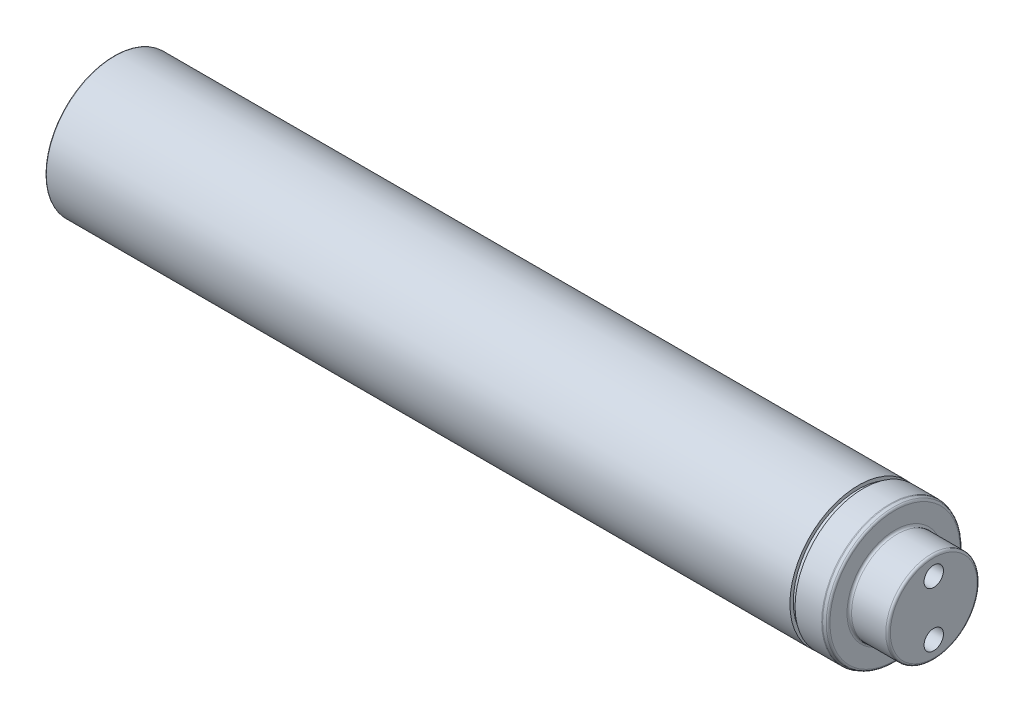
ISO-10303-21;
HEADER;
FILE_DESCRIPTION(('STEP AP214'),'2;1');
FILE_NAME('part.step','',(''),(''),'','','');
FILE_SCHEMA(('AUTOMOTIVE_DESIGN { 1 0 10303 214 1 1 1 1 }'));
ENDSEC;
DATA;
#1=APPLICATION_CONTEXT('core data for automotive mechanical design processes');
#2=APPLICATION_PROTOCOL_DEFINITION('international standard','automotive_design',2000,#1);
#3=PRODUCT_CONTEXT('',#1,'mechanical');
#4=PRODUCT('Part','Part','',(#3));
#5=PRODUCT_RELATED_PRODUCT_CATEGORY('part','',(#4));
#6=PRODUCT_DEFINITION_FORMATION('','',#4);
#7=PRODUCT_DEFINITION_CONTEXT('part definition',#1,'design');
#8=PRODUCT_DEFINITION('design','',#6,#7);
#9=PRODUCT_DEFINITION_SHAPE('','',#8);
#10=(LENGTH_UNIT() NAMED_UNIT(*) SI_UNIT(.MILLI.,.METRE.));
#11=(NAMED_UNIT(*) PLANE_ANGLE_UNIT() SI_UNIT($,.RADIAN.));
#12=(NAMED_UNIT(*) SI_UNIT($,.STERADIAN.) SOLID_ANGLE_UNIT());
#13=UNCERTAINTY_MEASURE_WITH_UNIT(LENGTH_MEASURE(1.E-05),#10,'distance_accuracy_value','');
#14=(GEOMETRIC_REPRESENTATION_CONTEXT(3) GLOBAL_UNCERTAINTY_ASSIGNED_CONTEXT((#13)) GLOBAL_UNIT_ASSIGNED_CONTEXT((#10,
#11,#12)) REPRESENTATION_CONTEXT('',''));
#15=CARTESIAN_POINT('',(0.,0.,0.));
#16=DIRECTION('',(0.,0.,1.));
#17=DIRECTION('',(1.,0.,0.));
#18=AXIS2_PLACEMENT_3D('',#15,#16,#17);
#19=CARTESIAN_POINT('',(-163.4,0.,0.));
#20=DIRECTION('',(-1.,0.,0.));
#21=DIRECTION('',(0.,0.,1.));
#22=AXIS2_PLACEMENT_3D('',#19,#20,#21);
#23=TOROIDAL_SURFACE('',#22,28.4000000000005,0.400000000000006);
#24=CARTESIAN_POINT('',(-163.,0.,-1.11022302462516E-13));
#25=DIRECTION('',(-1.,0.,0.));
#26=DIRECTION('',(0.,0.,1.));
#27=AXIS2_PLACEMENT_3D('',#24,#25,#26);
#28=CIRCLE('',#27,28.4000000000005);
#29=CARTESIAN_POINT('',(-163.,0.,28.4000000000005));
#30=VERTEX_POINT('',#29);
#31=EDGE_CURVE('E87',#30,#30,#28,.T.);
#32=ORIENTED_EDGE('',*,*,#31,.T.);
#33=EDGE_LOOP('',(#32));
#34=FACE_BOUND('',#33,.T.);
#35=CARTESIAN_POINT('',(-163.4,0.,0.));
#36=DIRECTION('',(-1.,0.,0.));
#37=DIRECTION('',(0.,0.,1.));
#38=AXIS2_PLACEMENT_3D('',#35,#36,#37);
#39=CIRCLE('',#38,28.0000000000005);
#40=CARTESIAN_POINT('',(-163.4,0.,28.0000000000006));
#41=VERTEX_POINT('',#40);
#42=EDGE_CURVE('E11',#41,#41,#39,.T.);
#43=ORIENTED_EDGE('',*,*,#42,.F.);
#44=EDGE_LOOP('',(#43));
#45=FACE_BOUND('',#44,.T.);
#46=ADVANCED_FACE('F49',(#34,#45),#23,.F.);
#47=CARTESIAN_POINT('',(-168.,0.,-1.11022302462516E-13));
#48=DIRECTION('',(-1.,0.,0.));
#49=DIRECTION('',(0.,0.,1.));
#50=AXIS2_PLACEMENT_3D('',#47,#48,#49);
#51=CYLINDRICAL_SURFACE('',#50,28.0000000000005);
#52=CARTESIAN_POINT('',(-164.,0.,-1.11022302462516E-13));
#53=DIRECTION('',(-1.,0.,0.));
#54=DIRECTION('',(0.,0.,1.));
#55=AXIS2_PLACEMENT_3D('',#52,#53,#54);
#56=CIRCLE('',#55,28.0000000000005);
#57=CARTESIAN_POINT('',(-164.,0.,28.0000000000005));
#58=VERTEX_POINT('',#57);
#59=EDGE_CURVE('E56',#58,#58,#56,.T.);
#60=ORIENTED_EDGE('',*,*,#59,.F.);
#61=EDGE_LOOP('',(#60));
#62=FACE_BOUND('',#61,.T.);
#63=ORIENTED_EDGE('',*,*,#42,.T.);
#64=EDGE_LOOP('',(#63));
#65=FACE_BOUND('',#64,.T.);
#66=ADVANCED_FACE('F154',(#62,#65),#51,.T.);
#67=CARTESIAN_POINT('',(-164.,28.0000000000009,0.));
#68=DIRECTION('',(1.,0.,0.));
#69=DIRECTION('',(0.,0.,-1.));
#70=AXIS2_PLACEMENT_3D('',#67,#68,#69);
#71=PLANE('',#70);
#72=CARTESIAN_POINT('',(-164.,0.,-1.11022302462516E-13));
#73=DIRECTION('',(-1.,0.,0.));
#74=DIRECTION('',(0.,0.,1.));
#75=AXIS2_PLACEMENT_3D('',#72,#73,#74);
#76=CIRCLE('',#75,25.2309401076756);
#77=CARTESIAN_POINT('',(-164.,0.,25.2309401076755));
#78=VERTEX_POINT('',#77);
#79=EDGE_CURVE('E147',#78,#78,#76,.T.);
#80=ORIENTED_EDGE('',*,*,#79,.F.);
#81=EDGE_LOOP('',(#80));
#82=FACE_BOUND('',#81,.T.);
#83=ORIENTED_EDGE('',*,*,#59,.T.);
#84=EDGE_LOOP('',(#83));
#85=FACE_BOUND('',#84,.T.);
#86=ADVANCED_FACE('F152',(#82,#85),#71,.F.);
#87=CARTESIAN_POINT('',(-164.4,0.,0.));
#88=DIRECTION('',(-1.,0.,0.));
#89=DIRECTION('',(0.,0.,1.));
#90=AXIS2_PLACEMENT_3D('',#87,#88,#89);
#91=TOROIDAL_SURFACE('',#90,25.2309401076756,0.400000000000032);
#92=ORIENTED_EDGE('',*,*,#79,.T.);
#93=EDGE_LOOP('',(#92));
#94=FACE_BOUND('',#93,.T.);
#95=CARTESIAN_POINT('',(-164.2,6.66133814775094E-13,2.22044604925031E-13));
#96=DIRECTION('',(-1.,0.,0.));
#97=DIRECTION('',(0.,0.,1.));
#98=AXIS2_PLACEMENT_3D('',#95,#96,#97);
#99=CIRCLE('',#98,24.884529946162);
#100=CARTESIAN_POINT('',(-164.2,6.67515183680254E-13,24.8845299461623));
#101=VERTEX_POINT('',#100);
#102=EDGE_CURVE('E144',#101,#101,#99,.T.);
#103=ORIENTED_EDGE('',*,*,#102,.F.);
#104=EDGE_LOOP('',(#103));
#105=FACE_BOUND('',#104,.T.);
#106=ADVANCED_FACE('F250',(#94,#105),#91,.F.);
#107=CARTESIAN_POINT('',(-164.2,6.66133814775094E-13,2.22044604925031E-13));
#108=DIRECTION('',(1.,0.,0.));
#109=DIRECTION('',(0.,0.,-1.));
#110=AXIS2_PLACEMENT_3D('',#107,#108,#109);
#111=CONICAL_SURFACE('',#110,24.884529946162,0.52359877559915);
#112=CARTESIAN_POINT('',(-167.8,0.,0.));
#113=DIRECTION('',(-1.,0.,0.));
#114=DIRECTION('',(0.,0.,1.));
#115=AXIS2_PLACEMENT_3D('',#112,#113,#114);
#116=CIRCLE('',#115,22.8060689770749);
#117=CARTESIAN_POINT('',(-167.8,0.,22.806068977075));
#118=VERTEX_POINT('',#117);
#119=EDGE_CURVE('E141',#118,#118,#116,.T.);
#120=ORIENTED_EDGE('',*,*,#119,.F.);
#121=EDGE_LOOP('',(#120));
#122=FACE_BOUND('',#121,.T.);
#123=ORIENTED_EDGE('',*,*,#102,.T.);
#124=EDGE_LOOP('',(#123));
#125=FACE_BOUND('',#124,.T.);
#126=ADVANCED_FACE('F246',(#122,#125),#111,.T.);
#127=CARTESIAN_POINT('',(-167.6,0.,0.));
#128=DIRECTION('',(-1.,0.,0.));
#129=DIRECTION('',(0.,0.,1.));
#130=AXIS2_PLACEMENT_3D('',#127,#128,#129);
#131=TOROIDAL_SURFACE('',#130,22.4596588155613,0.399999999999996);
#132=CARTESIAN_POINT('',(-168.,0.,-1.11022302462516E-13));
#133=DIRECTION('',(-1.,0.,0.));
#134=DIRECTION('',(0.,0.,1.));
#135=AXIS2_PLACEMENT_3D('',#132,#133,#134);
#136=CIRCLE('',#135,22.4596588155613);
#137=CARTESIAN_POINT('',(-168.,0.,22.4596588155613));
#138=VERTEX_POINT('',#137);
#139=EDGE_CURVE('E138',#138,#138,#136,.T.);
#140=ORIENTED_EDGE('',*,*,#139,.F.);
#141=EDGE_LOOP('',(#140));
#142=FACE_BOUND('',#141,.T.);
#143=ORIENTED_EDGE('',*,*,#119,.T.);
#144=EDGE_LOOP('',(#143));
#145=FACE_BOUND('',#144,.T.);
#146=ADVANCED_FACE('F242',(#142,#145),#131,.T.);
#147=CARTESIAN_POINT('',(-168.,22.4596588155623,-1.11022302462516E-13));
#148=DIRECTION('',(1.,0.,0.));
#149=DIRECTION('',(0.,0.,-1.));
#150=AXIS2_PLACEMENT_3D('',#147,#148,#149);
#151=PLANE('',#150);
#152=CARTESIAN_POINT('',(-168.,0.,-1.11022302462516E-13));
#153=DIRECTION('',(-1.,0.,0.));
#154=DIRECTION('',(0.,0.,1.));
#155=AXIS2_PLACEMENT_3D('',#152,#153,#154);
#156=CIRCLE('',#155,5.1);
#157=CARTESIAN_POINT('',(-168.,0.,5.0999999999999));
#158=VERTEX_POINT('',#157);
#159=EDGE_CURVE('E135',#158,#158,#156,.T.);
#160=ORIENTED_EDGE('',*,*,#159,.F.);
#161=EDGE_LOOP('',(#160));
#162=FACE_BOUND('',#161,.T.);
#163=ORIENTED_EDGE('',*,*,#139,.T.);
#164=EDGE_LOOP('',(#163));
#165=FACE_BOUND('',#164,.T.);
#166=ADVANCED_FACE('F238',(#162,#165),#151,.F.);
#167=CARTESIAN_POINT('',(-168.,0.,-1.11022302462516E-13));
#168=DIRECTION('',(-1.,0.,0.));
#169=DIRECTION('',(0.,0.,1.));
#170=AXIS2_PLACEMENT_3D('',#167,#168,#169);
#171=CYLINDRICAL_SURFACE('',#170,5.1);
#172=CARTESIAN_POINT('',(-148.,0.,-1.11022302462516E-13));
#173=DIRECTION('',(-1.,0.,0.));
#174=DIRECTION('',(0.,0.,1.));
#175=AXIS2_PLACEMENT_3D('',#172,#173,#174);
#176=CIRCLE('',#175,5.1);
#177=CARTESIAN_POINT('',(-148.,0.,5.0999999999999));
#178=VERTEX_POINT('',#177);
#179=EDGE_CURVE('E132',#178,#178,#176,.T.);
#180=ORIENTED_EDGE('',*,*,#179,.F.);
#181=EDGE_LOOP('',(#180));
#182=FACE_BOUND('',#181,.T.);
#183=ORIENTED_EDGE('',*,*,#159,.T.);
#184=EDGE_LOOP('',(#183));
#185=FACE_BOUND('',#184,.T.);
#186=ADVANCED_FACE('F235',(#182,#185),#171,.F.);
#187=CARTESIAN_POINT('',(-148.,0.,-1.11022302462516E-13));
#188=DIRECTION('',(-1.,0.,0.));
#189=DIRECTION('',(0.,0.,1.));
#190=AXIS2_PLACEMENT_3D('',#187,#188,#189);
#191=CONICAL_SURFACE('',#190,5.1,1.0471975511966);
#192=CARTESIAN_POINT('',(-145.055513627133,0.,-1.11022302462516E-13));
#193=VERTEX_POINT('',#192);
#194=VERTEX_LOOP('',#193);
#195=FACE_BOUND('',#194,.T.);
#196=ORIENTED_EDGE('',*,*,#179,.T.);
#197=EDGE_LOOP('',(#196));
#198=FACE_BOUND('',#197,.T.);
#199=ADVANCED_FACE('F231',(#195,#198),#191,.F.);
#200=CARTESIAN_POINT('',(196.,19.000000000001,3.88578058618805E-13));
#201=DIRECTION('',(1.,0.,0.));
#202=DIRECTION('',(0.,0.,-1.));
#203=AXIS2_PLACEMENT_3D('',#200,#201,#202);
#204=PLANE('',#203);
#205=CARTESIAN_POINT('',(196.,12.0000000000009,0.));
#206=DIRECTION('',(1.,0.,0.));
#207=DIRECTION('',(0.,0.,-1.));
#208=AXIS2_PLACEMENT_3D('',#205,#206,#207);
#209=CIRCLE('',#208,4.25);
#210=CARTESIAN_POINT('',(196.,12.0000000000009,-4.25000000000007));
#211=VERTEX_POINT('',#210);
#212=EDGE_CURVE('E77',#211,#211,#209,.T.);
#213=ORIENTED_EDGE('',*,*,#212,.F.);
#214=EDGE_LOOP('',(#213));
#215=FACE_BOUND('',#214,.T.);
#216=CARTESIAN_POINT('',(196.,-11.9999999999993,1.11022302462516E-13));
#217=DIRECTION('',(1.,0.,0.));
#218=DIRECTION('',(0.,0.,-1.));
#219=AXIS2_PLACEMENT_3D('',#216,#217,#218);
#220=CIRCLE('',#219,4.25);
#221=CARTESIAN_POINT('',(196.,-11.9999999999993,-4.2499999999999));
#222=VERTEX_POINT('',#221);
#223=EDGE_CURVE('E76',#222,#222,#220,.T.);
#224=ORIENTED_EDGE('',*,*,#223,.F.);
#225=EDGE_LOOP('',(#224));
#226=FACE_BOUND('',#225,.T.);
#227=CARTESIAN_POINT('',(196.,0.,-1.11022302462516E-13));
#228=DIRECTION('',(-1.,0.,0.));
#229=DIRECTION('',(0.,0.,1.));
#230=AXIS2_PLACEMENT_3D('',#227,#228,#229);
#231=CIRCLE('',#230,19.);
#232=CARTESIAN_POINT('',(196.,0.,18.9999999999999));
#233=VERTEX_POINT('',#232);
#234=EDGE_CURVE('E129',#233,#233,#231,.T.);
#235=ORIENTED_EDGE('',*,*,#234,.F.);
#236=EDGE_LOOP('',(#235));
#237=FACE_BOUND('',#236,.T.);
#238=ADVANCED_FACE('F227',(#215,#226,#237),#204,.T.);
#239=CARTESIAN_POINT('',(195.,6.66133814775094E-13,2.22044604925031E-13));
#240=DIRECTION('',(-1.,0.,0.));
#241=DIRECTION('',(0.,0.,1.));
#242=AXIS2_PLACEMENT_3D('',#239,#240,#241);
#243=TOROIDAL_SURFACE('',#242,19.,1.);
#244=ORIENTED_EDGE('',*,*,#234,.T.);
#245=EDGE_LOOP('',(#244));
#246=FACE_BOUND('',#245,.T.);
#247=CARTESIAN_POINT('',(195.,6.66133814775094E-13,2.22044604925031E-13));
#248=DIRECTION('',(-1.,0.,0.));
#249=DIRECTION('',(0.,0.,1.));
#250=AXIS2_PLACEMENT_3D('',#247,#248,#249);
#251=CIRCLE('',#250,20.);
#252=CARTESIAN_POINT('',(195.,6.67244037799719E-13,20.0000000000003));
#253=VERTEX_POINT('',#252);
#254=EDGE_CURVE('E126',#253,#253,#251,.T.);
#255=ORIENTED_EDGE('',*,*,#254,.F.);
#256=EDGE_LOOP('',(#255));
#257=FACE_BOUND('',#256,.T.);
#258=ADVANCED_FACE('F223',(#246,#257),#243,.T.);
#259=CARTESIAN_POINT('',(-168.,0.,-1.11022302462516E-13));
#260=DIRECTION('',(-1.,0.,0.));
#261=DIRECTION('',(0.,0.,1.));
#262=AXIS2_PLACEMENT_3D('',#259,#260,#261);
#263=CYLINDRICAL_SURFACE('',#262,20.);
#264=ORIENTED_EDGE('',*,*,#254,.T.);
#265=EDGE_LOOP('',(#264));
#266=FACE_BOUND('',#265,.T.);
#267=CARTESIAN_POINT('',(180.,0.,0.));
#268=DIRECTION('',(-1.,0.,0.));
#269=DIRECTION('',(0.,0.,1.));
#270=AXIS2_PLACEMENT_3D('',#267,#268,#269);
#271=CIRCLE('',#270,20.);
#272=CARTESIAN_POINT('',(180.,0.,20.));
#273=VERTEX_POINT('',#272);
#274=EDGE_CURVE('E123',#273,#273,#271,.T.);
#275=ORIENTED_EDGE('',*,*,#274,.F.);
#276=EDGE_LOOP('',(#275));
#277=FACE_BOUND('',#276,.T.);
#278=ADVANCED_FACE('F219',(#266,#277),#263,.T.);
#279=CARTESIAN_POINT('',(180.,0.,0.));
#280=DIRECTION('',(-1.,0.,0.));
#281=DIRECTION('',(0.,0.,1.));
#282=AXIS2_PLACEMENT_3D('',#279,#280,#281);
#283=TOROIDAL_SURFACE('',#282,21.,1.);
#284=CARTESIAN_POINT('',(179.,0.,0.));
#285=DIRECTION('',(-1.,0.,0.));
#286=DIRECTION('',(0.,0.,1.));
#287=AXIS2_PLACEMENT_3D('',#284,#285,#286);
#288=CIRCLE('',#287,21.);
#289=CARTESIAN_POINT('',(179.,0.,21.));
#290=VERTEX_POINT('',#289);
#291=EDGE_CURVE('E120',#290,#290,#288,.T.);
#292=ORIENTED_EDGE('',*,*,#291,.F.);
#293=EDGE_LOOP('',(#292));
#294=FACE_BOUND('',#293,.T.);
#295=ORIENTED_EDGE('',*,*,#274,.T.);
#296=EDGE_LOOP('',(#295));
#297=FACE_BOUND('',#296,.T.);
#298=ADVANCED_FACE('F215',(#294,#297),#283,.F.);
#299=CARTESIAN_POINT('',(179.,28.471851993259,2.22044604925031E-13));
#300=DIRECTION('',(1.,0.,0.));
#301=DIRECTION('',(0.,0.,-1.));
#302=AXIS2_PLACEMENT_3D('',#299,#300,#301);
#303=PLANE('',#302);
#304=ORIENTED_EDGE('',*,*,#291,.T.);
#305=EDGE_LOOP('',(#304));
#306=FACE_BOUND('',#305,.T.);
#307=CARTESIAN_POINT('',(179.,0.,0.));
#308=DIRECTION('',(-1.,0.,0.));
#309=DIRECTION('',(0.,0.,1.));
#310=AXIS2_PLACEMENT_3D('',#307,#308,#309);
#311=CIRCLE('',#310,28.4718519932579);
#312=CARTESIAN_POINT('',(179.,0.,28.471851993258));
#313=VERTEX_POINT('',#312);
#314=EDGE_CURVE('E117',#313,#313,#311,.T.);
#315=ORIENTED_EDGE('',*,*,#314,.F.);
#316=EDGE_LOOP('',(#315));
#317=FACE_BOUND('',#316,.T.);
#318=ADVANCED_FACE('F211',(#306,#317),#303,.T.);
#319=CARTESIAN_POINT('',(178.,0.,0.));
#320=DIRECTION('',(-1.,0.,0.));
#321=DIRECTION('',(0.,0.,1.));
#322=AXIS2_PLACEMENT_3D('',#319,#320,#321);
#323=TOROIDAL_SURFACE('',#322,28.4718519932579,1.);
#324=CARTESIAN_POINT('',(178.342020143326,0.,0.));
#325=DIRECTION('',(-1.,0.,0.));
#326=DIRECTION('',(0.,0.,1.));
#327=AXIS2_PLACEMENT_3D('',#324,#325,#326);
#328=CIRCLE('',#327,29.4115446140438);
#329=CARTESIAN_POINT('',(178.342020143326,0.,29.4115446140439));
#330=VERTEX_POINT('',#329);
#331=EDGE_CURVE('E114',#330,#330,#328,.T.);
#332=ORIENTED_EDGE('',*,*,#331,.F.);
#333=EDGE_LOOP('',(#332));
#334=FACE_BOUND('',#333,.T.);
#335=ORIENTED_EDGE('',*,*,#314,.T.);
#336=EDGE_LOOP('',(#335));
#337=FACE_BOUND('',#336,.T.);
#338=ADVANCED_FACE('F207',(#334,#337),#323,.T.);
#339=CARTESIAN_POINT('',(178.342020143326,0.,0.));
#340=DIRECTION('',(-1.,0.,0.));
#341=DIRECTION('',(0.,0.,1.));
#342=AXIS2_PLACEMENT_3D('',#339,#340,#341);
#343=CONICAL_SURFACE('',#342,29.4115446140438,0.349065850398855);
#344=CARTESIAN_POINT('',(177.165693162617,0.,0.));
#345=DIRECTION('',(-1.,0.,0.));
#346=DIRECTION('',(0.,0.,1.));
#347=AXIS2_PLACEMENT_3D('',#344,#345,#346);
#348=CIRCLE('',#347,29.8396926207859);
#349=CARTESIAN_POINT('',(177.165693162617,0.,29.839692620786));
#350=VERTEX_POINT('',#349);
#351=EDGE_CURVE('E111',#350,#350,#348,.T.);
#352=ORIENTED_EDGE('',*,*,#351,.F.);
#353=EDGE_LOOP('',(#352));
#354=FACE_BOUND('',#353,.T.);
#355=ORIENTED_EDGE('',*,*,#331,.T.);
#356=EDGE_LOOP('',(#355));
#357=FACE_BOUND('',#356,.T.);
#358=ADVANCED_FACE('F203',(#354,#357),#343,.T.);
#359=CARTESIAN_POINT('',(176.823673019292,0.,0.));
#360=DIRECTION('',(-1.,0.,0.));
#361=DIRECTION('',(0.,0.,1.));
#362=AXIS2_PLACEMENT_3D('',#359,#360,#361);
#363=TOROIDAL_SURFACE('',#362,28.9,1.);
#364=ORIENTED_EDGE('',*,*,#351,.T.);
#365=EDGE_LOOP('',(#364));
#366=FACE_BOUND('',#365,.T.);
#367=CARTESIAN_POINT('',(176.823673019292,0.,0.));
#368=DIRECTION('',(-1.,0.,0.));
#369=DIRECTION('',(0.,0.,1.));
#370=AXIS2_PLACEMENT_3D('',#367,#368,#369);
#371=CIRCLE('',#370,29.9);
#372=CARTESIAN_POINT('',(176.823673019292,0.,29.9000000000001));
#373=VERTEX_POINT('',#372);
#374=EDGE_CURVE('E108',#373,#373,#371,.T.);
#375=ORIENTED_EDGE('',*,*,#374,.F.);
#376=EDGE_LOOP('',(#375));
#377=FACE_BOUND('',#376,.T.);
#378=ADVANCED_FACE('F199',(#366,#377),#363,.T.);
#379=CARTESIAN_POINT('',(-168.,0.,-1.11022302462516E-13));
#380=DIRECTION('',(-1.,0.,0.));
#381=DIRECTION('',(0.,0.,1.));
#382=AXIS2_PLACEMENT_3D('',#379,#380,#381);
#383=CYLINDRICAL_SURFACE('',#382,29.9);
#384=ORIENTED_EDGE('',*,*,#374,.T.);
#385=EDGE_LOOP('',(#384));
#386=FACE_BOUND('',#385,.T.);
#387=CARTESIAN_POINT('',(165.15,0.,0.));
#388=DIRECTION('',(-1.,0.,0.));
#389=DIRECTION('',(0.,0.,1.));
#390=AXIS2_PLACEMENT_3D('',#387,#388,#389);
#391=CIRCLE('',#390,29.9);
#392=CARTESIAN_POINT('',(165.15,0.,29.9000000000001));
#393=VERTEX_POINT('',#392);
#394=EDGE_CURVE('E105',#393,#393,#391,.T.);
#395=ORIENTED_EDGE('',*,*,#394,.F.);
#396=EDGE_LOOP('',(#395));
#397=FACE_BOUND('',#396,.T.);
#398=ADVANCED_FACE('F195',(#386,#397),#383,.T.);
#399=CARTESIAN_POINT('',(165.15,28.5000000000011,3.33066907387547E-13));
#400=DIRECTION('',(-1.,0.,0.));
#401=DIRECTION('',(0.,0.,1.));
#402=AXIS2_PLACEMENT_3D('',#399,#400,#401);
#403=PLANE('',#402);
#404=ORIENTED_EDGE('',*,*,#394,.T.);
#405=EDGE_LOOP('',(#404));
#406=FACE_BOUND('',#405,.T.);
#407=CARTESIAN_POINT('',(165.15,0.,0.));
#408=DIRECTION('',(-1.,0.,0.));
#409=DIRECTION('',(0.,0.,1.));
#410=AXIS2_PLACEMENT_3D('',#407,#408,#409);
#411=CIRCLE('',#410,28.5000000000001);
#412=CARTESIAN_POINT('',(165.15,0.,28.5000000000002));
#413=VERTEX_POINT('',#412);
#414=EDGE_CURVE('E102',#413,#413,#411,.T.);
#415=ORIENTED_EDGE('',*,*,#414,.F.);
#416=EDGE_LOOP('',(#415));
#417=FACE_BOUND('',#416,.T.);
#418=ADVANCED_FACE('F191',(#406,#417),#403,.T.);
#419=CARTESIAN_POINT('',(-168.,0.,-1.11022302462516E-13));
#420=DIRECTION('',(-1.,0.,0.));
#421=DIRECTION('',(0.,0.,1.));
#422=AXIS2_PLACEMENT_3D('',#419,#420,#421);
#423=CYLINDRICAL_SURFACE('',#422,28.5000000000001);
#424=ORIENTED_EDGE('',*,*,#414,.T.);
#425=EDGE_LOOP('',(#424));
#426=FACE_BOUND('',#425,.T.);
#427=CARTESIAN_POINT('',(163.,0.,0.));
#428=DIRECTION('',(-1.,0.,0.));
#429=DIRECTION('',(0.,0.,1.));
#430=AXIS2_PLACEMENT_3D('',#427,#428,#429);
#431=CIRCLE('',#430,28.5000000000001);
#432=CARTESIAN_POINT('',(163.,0.,28.5000000000002));
#433=VERTEX_POINT('',#432);
#434=EDGE_CURVE('E99',#433,#433,#431,.T.);
#435=ORIENTED_EDGE('',*,*,#434,.F.);
#436=EDGE_LOOP('',(#435));
#437=FACE_BOUND('',#436,.T.);
#438=ADVANCED_FACE('F187',(#426,#437),#423,.T.);
#439=CARTESIAN_POINT('',(163.,30.0000000000005,1.66533453693773E-13));
#440=DIRECTION('',(1.,0.,0.));
#441=DIRECTION('',(0.,0.,-1.));
#442=AXIS2_PLACEMENT_3D('',#439,#440,#441);
#443=PLANE('',#442);
#444=ORIENTED_EDGE('',*,*,#434,.T.);
#445=EDGE_LOOP('',(#444));
#446=FACE_BOUND('',#445,.T.);
#447=CARTESIAN_POINT('',(163.,0.,0.));
#448=DIRECTION('',(-1.,0.,0.));
#449=DIRECTION('',(0.,0.,1.));
#450=AXIS2_PLACEMENT_3D('',#447,#448,#449);
#451=CIRCLE('',#450,29.9999999999999);
#452=CARTESIAN_POINT('',(163.,0.,30.));
#453=VERTEX_POINT('',#452);
#454=EDGE_CURVE('E96',#453,#453,#451,.T.);
#455=ORIENTED_EDGE('',*,*,#454,.F.);
#456=EDGE_LOOP('',(#455));
#457=FACE_BOUND('',#456,.T.);
#458=ADVANCED_FACE('F180',(#446,#457),#443,.T.);
#459=CARTESIAN_POINT('',(-168.,0.,-1.11022302462516E-13));
#460=DIRECTION('',(-1.,0.,0.));
#461=DIRECTION('',(0.,0.,1.));
#462=AXIS2_PLACEMENT_3D('',#459,#460,#461);
#463=CYLINDRICAL_SURFACE('',#462,29.9999999999999);
#464=CARTESIAN_POINT('',(-162.6,0.,0.));
#465=DIRECTION('',(-1.,0.,0.));
#466=DIRECTION('',(0.,0.,1.));
#467=AXIS2_PLACEMENT_3D('',#464,#465,#466);
#468=CIRCLE('',#467,29.9999999999999);
#469=CARTESIAN_POINT('',(-162.6,0.,30.));
#470=VERTEX_POINT('',#469);
#471=EDGE_CURVE('E93',#470,#470,#468,.T.);
#472=ORIENTED_EDGE('',*,*,#471,.F.);
#473=EDGE_LOOP('',(#472));
#474=FACE_BOUND('',#473,.T.);
#475=ORIENTED_EDGE('',*,*,#454,.T.);
#476=EDGE_LOOP('',(#475));
#477=FACE_BOUND('',#476,.T.);
#478=ADVANCED_FACE('F174',(#474,#477),#463,.T.);
#479=CARTESIAN_POINT('',(-162.6,0.,0.));
#480=DIRECTION('',(-1.,0.,0.));
#481=DIRECTION('',(0.,0.,1.));
#482=AXIS2_PLACEMENT_3D('',#479,#480,#481);
#483=TOROIDAL_SURFACE('',#482,29.5999999999999,0.400000000000006);
#484=ORIENTED_EDGE('',*,*,#471,.T.);
#485=EDGE_LOOP('',(#484));
#486=FACE_BOUND('',#485,.T.);
#487=CARTESIAN_POINT('',(-163.,0.,-1.11022302462516E-13));
#488=DIRECTION('',(-1.,0.,0.));
#489=DIRECTION('',(0.,0.,1.));
#490=AXIS2_PLACEMENT_3D('',#487,#488,#489);
#491=CIRCLE('',#490,29.5999999999999);
#492=CARTESIAN_POINT('',(-163.,0.,29.5999999999998));
#493=VERTEX_POINT('',#492);
#494=EDGE_CURVE('E90',#493,#493,#491,.T.);
#495=ORIENTED_EDGE('',*,*,#494,.F.);
#496=EDGE_LOOP('',(#495));
#497=FACE_BOUND('',#496,.T.);
#498=ADVANCED_FACE('F169',(#486,#497),#483,.T.);
#499=CARTESIAN_POINT('',(-163.,29.6000000000005,0.));
#500=DIRECTION('',(1.,0.,0.));
#501=DIRECTION('',(0.,0.,-1.));
#502=AXIS2_PLACEMENT_3D('',#499,#500,#501);
#503=PLANE('',#502);
#504=ORIENTED_EDGE('',*,*,#31,.F.);
#505=EDGE_LOOP('',(#504));
#506=FACE_BOUND('',#505,.T.);
#507=ORIENTED_EDGE('',*,*,#494,.T.);
#508=EDGE_LOOP('',(#507));
#509=FACE_BOUND('',#508,.T.);
#510=ADVANCED_FACE('F165',(#506,#509),#503,.F.);
#511=CARTESIAN_POINT('',(176.,-11.9999999999993,2.22044604925031E-13));
#512=DIRECTION('',(1.,0.,0.));
#513=DIRECTION('',(0.,0.,-1.));
#514=AXIS2_PLACEMENT_3D('',#511,#512,#513);
#515=CONICAL_SURFACE('',#514,4.25,1.02974425867666);
#516=CARTESIAN_POINT('',(173.446342369133,-11.9999999999993,2.22044604925031E-13));
#517=VERTEX_POINT('',#516);
#518=VERTEX_LOOP('',#517);
#519=FACE_BOUND('',#518,.T.);
#520=CARTESIAN_POINT('',(176.,-11.9999999999993,2.22044604925031E-13));
#521=DIRECTION('',(1.,0.,0.));
#522=DIRECTION('',(0.,0.,-1.));
#523=AXIS2_PLACEMENT_3D('',#520,#521,#522);
#524=CIRCLE('',#523,4.25);
#525=CARTESIAN_POINT('',(176.,-11.9999999999993,-4.24999999999979));
#526=VERTEX_POINT('',#525);
#527=EDGE_CURVE('E80',#526,#526,#524,.T.);
#528=ORIENTED_EDGE('',*,*,#527,.T.);
#529=EDGE_LOOP('',(#528));
#530=FACE_BOUND('',#529,.T.);
#531=ADVANCED_FACE('F168',(#519,#530),#515,.F.);
#532=CARTESIAN_POINT('',(196.,-11.9999999999993,1.11022302462516E-13));
#533=DIRECTION('',(1.,0.,0.));
#534=DIRECTION('',(0.,0.,-1.));
#535=AXIS2_PLACEMENT_3D('',#532,#533,#534);
#536=CYLINDRICAL_SURFACE('',#535,4.25);
#537=ORIENTED_EDGE('',*,*,#527,.F.);
#538=EDGE_LOOP('',(#537));
#539=FACE_BOUND('',#538,.T.);
#540=ORIENTED_EDGE('',*,*,#223,.T.);
#541=EDGE_LOOP('',(#540));
#542=FACE_BOUND('',#541,.T.);
#543=ADVANCED_FACE('F70',(#539,#542),#536,.F.);
#544=CARTESIAN_POINT('',(176.,12.0000000000011,0.));
#545=DIRECTION('',(1.,0.,0.));
#546=DIRECTION('',(0.,0.,-1.));
#547=AXIS2_PLACEMENT_3D('',#544,#545,#546);
#548=CONICAL_SURFACE('',#547,4.25,1.02974425867666);
#549=CARTESIAN_POINT('',(173.446342369133,12.0000000000011,0.));
#550=VERTEX_POINT('',#549);
#551=VERTEX_LOOP('',#550);
#552=FACE_BOUND('',#551,.T.);
#553=CARTESIAN_POINT('',(176.,12.0000000000011,0.));
#554=DIRECTION('',(1.,0.,0.));
#555=DIRECTION('',(0.,0.,-1.));
#556=AXIS2_PLACEMENT_3D('',#553,#554,#555);
#557=CIRCLE('',#556,4.25);
#558=CARTESIAN_POINT('',(176.,12.0000000000011,-4.25000000000006));
#559=VERTEX_POINT('',#558);
#560=EDGE_CURVE('E74',#559,#559,#557,.T.);
#561=ORIENTED_EDGE('',*,*,#560,.T.);
#562=EDGE_LOOP('',(#561));
#563=FACE_BOUND('',#562,.T.);
#564=ADVANCED_FACE('F66',(#552,#563),#548,.F.);
#565=CARTESIAN_POINT('',(196.,12.0000000000009,0.));
#566=DIRECTION('',(1.,0.,0.));
#567=DIRECTION('',(0.,0.,-1.));
#568=AXIS2_PLACEMENT_3D('',#565,#566,#567);
#569=CYLINDRICAL_SURFACE('',#568,4.25);
#570=ORIENTED_EDGE('',*,*,#560,.F.);
#571=EDGE_LOOP('',(#570));
#572=FACE_BOUND('',#571,.T.);
#573=ORIENTED_EDGE('',*,*,#212,.T.);
#574=EDGE_LOOP('',(#573));
#575=FACE_BOUND('',#574,.T.);
#576=ADVANCED_FACE('F69',(#572,#575),#569,.F.);
#577=CLOSED_SHELL('',(#46,#66,#86,#106,#126,#146,#166,#186,#199,#238,#258,#278,#298,#318,#338,
#358,#378,#398,#418,#438,#458,#478,#498,#510,#531,#543,#564,#576));
#578=MANIFOLD_SOLID_BREP('B2',#577);
#579=ADVANCED_BREP_SHAPE_REPRESENTATION('',(#18,#578),#14);
#580=SHAPE_DEFINITION_REPRESENTATION(#9,#579);
ENDSEC;
END-ISO-10303-21;
